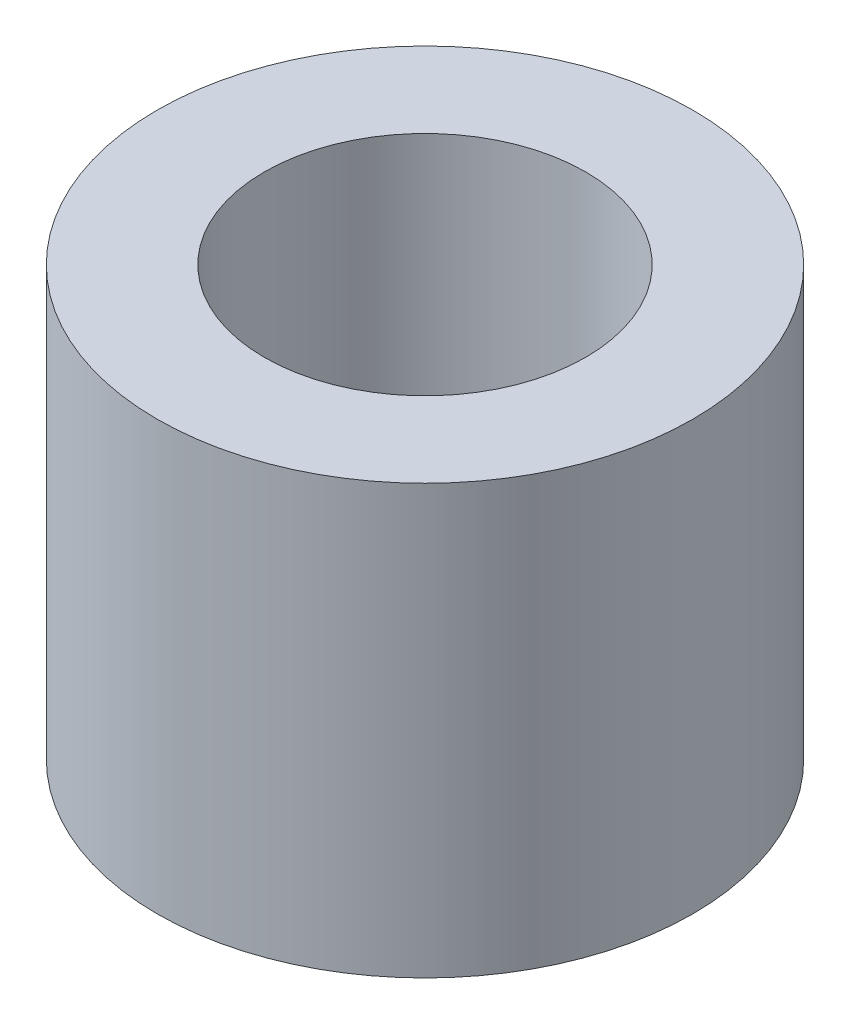
ISO-10303-21;
HEADER;
FILE_DESCRIPTION(('STEP AP214'),'2;1');
FILE_NAME('part.step','',(''),(''),'','','');
FILE_SCHEMA(('AUTOMOTIVE_DESIGN { 1 0 10303 214 1 1 1 1 }'));
ENDSEC;
DATA;
#1=APPLICATION_CONTEXT('core data for automotive mechanical design processes');
#2=APPLICATION_PROTOCOL_DEFINITION('international standard','automotive_design',2000,#1);
#3=PRODUCT_CONTEXT('',#1,'mechanical');
#4=PRODUCT('Part','Part','',(#3));
#5=PRODUCT_RELATED_PRODUCT_CATEGORY('part','',(#4));
#6=PRODUCT_DEFINITION_FORMATION('','',#4);
#7=PRODUCT_DEFINITION_CONTEXT('part definition',#1,'design');
#8=PRODUCT_DEFINITION('design','',#6,#7);
#9=PRODUCT_DEFINITION_SHAPE('','',#8);
#10=(LENGTH_UNIT() NAMED_UNIT(*) SI_UNIT(.MILLI.,.METRE.));
#11=(NAMED_UNIT(*) PLANE_ANGLE_UNIT() SI_UNIT($,.RADIAN.));
#12=(NAMED_UNIT(*) SI_UNIT($,.STERADIAN.) SOLID_ANGLE_UNIT());
#13=UNCERTAINTY_MEASURE_WITH_UNIT(LENGTH_MEASURE(1.E-05),#10,'distance_accuracy_value','');
#14=(GEOMETRIC_REPRESENTATION_CONTEXT(3) GLOBAL_UNCERTAINTY_ASSIGNED_CONTEXT((#13)) GLOBAL_UNIT_ASSIGNED_CONTEXT((#10,
#11,#12)) REPRESENTATION_CONTEXT('',''));
#15=CARTESIAN_POINT('',(0.,0.,0.));
#16=DIRECTION('',(0.,0.,1.));
#17=DIRECTION('',(1.,0.,0.));
#18=AXIS2_PLACEMENT_3D('',#15,#16,#17);
#19=CARTESIAN_POINT('',(0.,5.08,0.));
#20=DIRECTION('',(0.,1.,0.));
#21=DIRECTION('',(0.,0.,1.));
#22=AXIS2_PLACEMENT_3D('',#19,#20,#21);
#23=PLANE('',#22);
#24=CARTESIAN_POINT('',(0.,5.08,0.));
#25=DIRECTION('',(0.,1.,0.));
#26=DIRECTION('',(0.,0.,1.));
#27=AXIS2_PLACEMENT_3D('',#24,#25,#26);
#28=CIRCLE('',#27,3.175);
#29=CARTESIAN_POINT('',(0.,5.08,3.175));
#30=VERTEX_POINT('',#29);
#31=EDGE_CURVE('E10',#30,#30,#28,.T.);
#32=ORIENTED_EDGE('',*,*,#31,.T.);
#33=EDGE_LOOP('',(#32));
#34=FACE_BOUND('',#33,.T.);
#35=CARTESIAN_POINT('',(0.,5.08,0.));
#36=DIRECTION('',(0.,1.,0.));
#37=DIRECTION('',(0.,0.,1.));
#38=AXIS2_PLACEMENT_3D('',#35,#36,#37);
#39=CIRCLE('',#38,1.905);
#40=CARTESIAN_POINT('',(0.,5.08,1.905));
#41=VERTEX_POINT('',#40);
#42=EDGE_CURVE('E48',#41,#41,#39,.T.);
#43=ORIENTED_EDGE('',*,*,#42,.F.);
#44=EDGE_LOOP('',(#43));
#45=FACE_BOUND('',#44,.T.);
#46=ADVANCED_FACE('F37',(#34,#45),#23,.T.);
#47=CARTESIAN_POINT('',(0.,0.,0.));
#48=DIRECTION('',(0.,1.,0.));
#49=DIRECTION('',(0.,0.,1.));
#50=AXIS2_PLACEMENT_3D('',#47,#48,#49);
#51=PLANE('',#50);
#52=CARTESIAN_POINT('',(0.,0.,0.));
#53=DIRECTION('',(0.,1.,0.));
#54=DIRECTION('',(0.,0.,1.));
#55=AXIS2_PLACEMENT_3D('',#52,#53,#54);
#56=CIRCLE('',#55,3.175);
#57=CARTESIAN_POINT('',(0.,0.,3.175));
#58=VERTEX_POINT('',#57);
#59=EDGE_CURVE('E41',#58,#58,#56,.T.);
#60=ORIENTED_EDGE('',*,*,#59,.F.);
#61=EDGE_LOOP('',(#60));
#62=FACE_BOUND('',#61,.T.);
#63=CARTESIAN_POINT('',(0.,0.,0.));
#64=DIRECTION('',(0.,1.,0.));
#65=DIRECTION('',(0.,0.,1.));
#66=AXIS2_PLACEMENT_3D('',#63,#64,#65);
#67=CIRCLE('',#66,1.905);
#68=CARTESIAN_POINT('',(0.,0.,1.905));
#69=VERTEX_POINT('',#68);
#70=EDGE_CURVE('E50',#69,#69,#67,.T.);
#71=ORIENTED_EDGE('',*,*,#70,.T.);
#72=EDGE_LOOP('',(#71));
#73=FACE_BOUND('',#72,.T.);
#74=ADVANCED_FACE('F60',(#62,#73),#51,.F.);
#75=CARTESIAN_POINT('',(0.,5.08,0.));
#76=DIRECTION('',(0.,-1.,0.));
#77=DIRECTION('',(0.,0.,-1.));
#78=AXIS2_PLACEMENT_3D('',#75,#76,#77);
#79=CYLINDRICAL_SURFACE('',#78,3.175);
#80=ORIENTED_EDGE('',*,*,#31,.F.);
#81=EDGE_LOOP('',(#80));
#82=FACE_BOUND('',#81,.T.);
#83=ORIENTED_EDGE('',*,*,#59,.T.);
#84=EDGE_LOOP('',(#83));
#85=FACE_BOUND('',#84,.T.);
#86=ADVANCED_FACE('F39',(#82,#85),#79,.T.);
#87=CARTESIAN_POINT('',(0.,5.08,0.));
#88=DIRECTION('',(0.,-1.,0.));
#89=DIRECTION('',(0.,0.,-1.));
#90=AXIS2_PLACEMENT_3D('',#87,#88,#89);
#91=CYLINDRICAL_SURFACE('',#90,1.905);
#92=ORIENTED_EDGE('',*,*,#42,.T.);
#93=EDGE_LOOP('',(#92));
#94=FACE_BOUND('',#93,.T.);
#95=ORIENTED_EDGE('',*,*,#70,.F.);
#96=EDGE_LOOP('',(#95));
#97=FACE_BOUND('',#96,.T.);
#98=ADVANCED_FACE('F56',(#94,#97),#91,.F.);
#99=CLOSED_SHELL('',(#46,#74,#86,#98));
#100=MANIFOLD_SOLID_BREP('B2',#99);
#101=ADVANCED_BREP_SHAPE_REPRESENTATION('',(#18,#100),#14);
#102=SHAPE_DEFINITION_REPRESENTATION(#9,#101);
ENDSEC;
END-ISO-10303-21;
